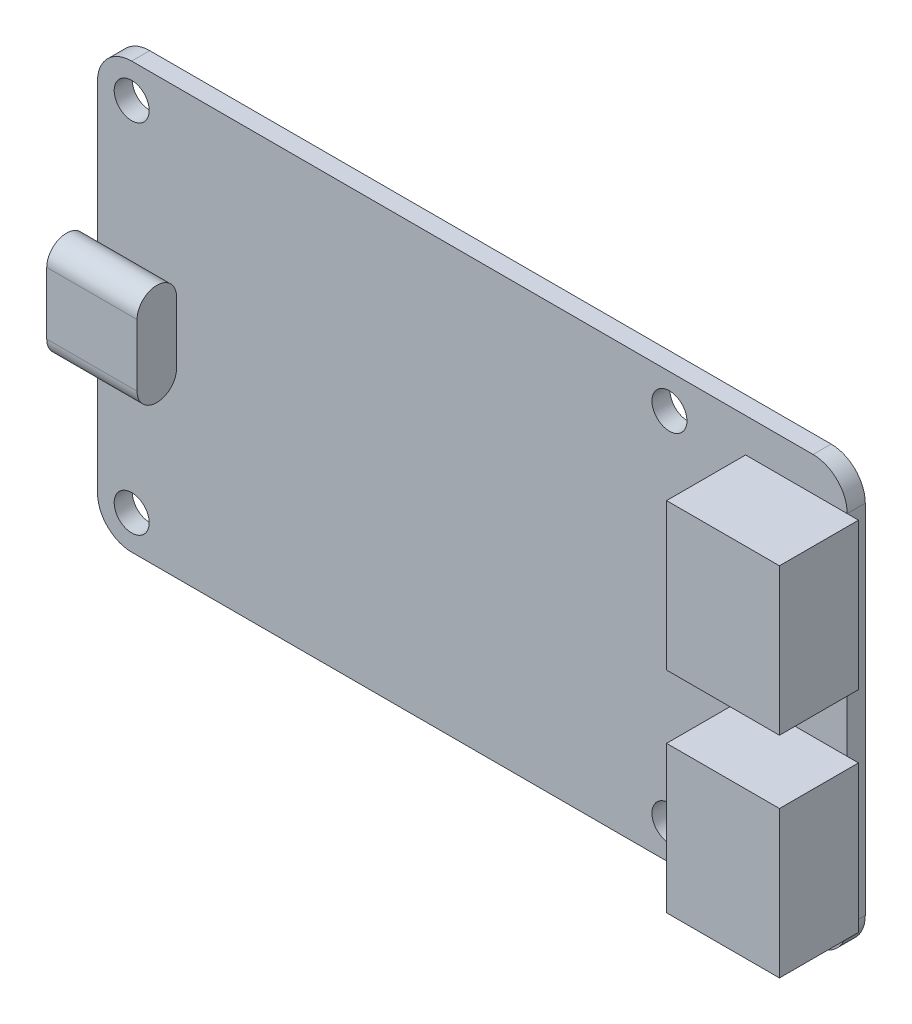
ISO-10303-21;
HEADER;
FILE_DESCRIPTION(('STEP AP214'),'2;1');
FILE_NAME('part.step','',(''),(''),'','','');
FILE_SCHEMA(('AUTOMOTIVE_DESIGN { 1 0 10303 214 1 1 1 1 }'));
ENDSEC;
DATA;
#1=APPLICATION_CONTEXT('core data for automotive mechanical design processes');
#2=APPLICATION_PROTOCOL_DEFINITION('international standard','automotive_design',2000,#1);
#3=PRODUCT_CONTEXT('',#1,'mechanical');
#4=PRODUCT('Part','Part','',(#3));
#5=PRODUCT_RELATED_PRODUCT_CATEGORY('part','',(#4));
#6=PRODUCT_DEFINITION_FORMATION('','',#4);
#7=PRODUCT_DEFINITION_CONTEXT('part definition',#1,'design');
#8=PRODUCT_DEFINITION('design','',#6,#7);
#9=PRODUCT_DEFINITION_SHAPE('','',#8);
#10=(LENGTH_UNIT() NAMED_UNIT(*) SI_UNIT(.MILLI.,.METRE.));
#11=(NAMED_UNIT(*) PLANE_ANGLE_UNIT() SI_UNIT($,.RADIAN.));
#12=(NAMED_UNIT(*) SI_UNIT($,.STERADIAN.) SOLID_ANGLE_UNIT());
#13=UNCERTAINTY_MEASURE_WITH_UNIT(LENGTH_MEASURE(1.E-05),#10,'distance_accuracy_value','');
#14=(GEOMETRIC_REPRESENTATION_CONTEXT(3) GLOBAL_UNCERTAINTY_ASSIGNED_CONTEXT((#13)) GLOBAL_UNIT_ASSIGNED_CONTEXT((#10,
#11,#12)) REPRESENTATION_CONTEXT('',''));
#15=CARTESIAN_POINT('',(0.,0.,0.));
#16=DIRECTION('',(0.,0.,1.));
#17=DIRECTION('',(1.,0.,0.));
#18=AXIS2_PLACEMENT_3D('',#15,#16,#17);
#19=CARTESIAN_POINT('',(-30.175,-15.81,1.6));
#20=DIRECTION('',(0.,0.,1.));
#21=DIRECTION('',(1.,0.,0.));
#22=AXIS2_PLACEMENT_3D('',#19,#20,#21);
#23=PLANE('',#22);
#24=DIRECTION('',(-1.,0.,0.));
#25=VECTOR('',#24,1.);
#26=CARTESIAN_POINT('',(-26.2,2.74999999999999,1.6));
#27=LINE('',#26,#25);
#28=CARTESIAN_POINT('',(-26.2,2.74999999999999,1.6));
#29=VERTEX_POINT('',#28);
#30=CARTESIAN_POINT('',(-33.2,2.74999999999999,1.6));
#31=VERTEX_POINT('',#30);
#32=EDGE_CURVE('E54',#29,#31,#27,.T.);
#33=ORIENTED_EDGE('',*,*,#32,.F.);
#34=DIRECTION('',(0.,-1.,0.));
#35=VECTOR('',#34,1.);
#36=CARTESIAN_POINT('',(-26.2,2.74999999999999,1.6));
#37=LINE('',#36,#35);
#38=CARTESIAN_POINT('',(-26.2,-2.75000000000001,1.6));
#39=VERTEX_POINT('',#38);
#40=EDGE_CURVE('E49',#29,#39,#37,.T.);
#41=ORIENTED_EDGE('',*,*,#40,.T.);
#42=DIRECTION('',(-1.,0.,0.));
#43=VECTOR('',#42,1.);
#44=CARTESIAN_POINT('',(-26.2,-2.75,1.6));
#45=LINE('',#44,#43);
#46=CARTESIAN_POINT('',(-33.2,-2.75000000000001,1.6));
#47=VERTEX_POINT('',#46);
#48=EDGE_CURVE('E224',#39,#47,#45,.T.);
#49=ORIENTED_EDGE('',*,*,#48,.T.);
#50=DIRECTION('',(0.,-1.,0.));
#51=VECTOR('',#50,1.);
#52=CARTESIAN_POINT('',(-33.2,15.81,1.6));
#53=LINE('',#52,#51);
#54=CARTESIAN_POINT('',(-33.2,-15.81,1.6));
#55=VERTEX_POINT('',#54);
#56=EDGE_CURVE('E335',#47,#55,#53,.T.);
#57=ORIENTED_EDGE('',*,*,#56,.T.);
#58=CARTESIAN_POINT('',(-30.175,-15.81,1.6));
#59=DIRECTION('',(0.,0.,1.));
#60=DIRECTION('',(1.,0.,0.));
#61=AXIS2_PLACEMENT_3D('',#58,#59,#60);
#62=CIRCLE('',#61,3.02499999999999);
#63=CARTESIAN_POINT('',(-30.175,-18.835,1.6));
#64=VERTEX_POINT('',#63);
#65=EDGE_CURVE('E316',#55,#64,#62,.T.);
#66=ORIENTED_EDGE('',*,*,#65,.T.);
#67=DIRECTION('',(1.,0.,0.));
#68=VECTOR('',#67,1.);
#69=CARTESIAN_POINT('',(-30.175,-18.835,1.6));
#70=LINE('',#69,#68);
#71=CARTESIAN_POINT('',(30.175,-18.835,1.6));
#72=VERTEX_POINT('',#71);
#73=EDGE_CURVE('E319',#64,#72,#70,.T.);
#74=ORIENTED_EDGE('',*,*,#73,.T.);
#75=CARTESIAN_POINT('',(30.175,-15.81,1.6));
#76=DIRECTION('',(0.,0.,1.));
#77=DIRECTION('',(1.,0.,0.));
#78=AXIS2_PLACEMENT_3D('',#75,#76,#77);
#79=CIRCLE('',#78,3.025);
#80=CARTESIAN_POINT('',(33.2,-15.81,1.6));
#81=VERTEX_POINT('',#80);
#82=EDGE_CURVE('E322',#72,#81,#79,.T.);
#83=ORIENTED_EDGE('',*,*,#82,.T.);
#84=DIRECTION('',(1.,0.,0.));
#85=VECTOR('',#84,1.);
#86=CARTESIAN_POINT('',(24.2,-15.81,1.6));
#87=LINE('',#86,#85);
#88=CARTESIAN_POINT('',(24.2,-15.81,1.6));
#89=VERTEX_POINT('',#88);
#90=EDGE_CURVE('E240',#89,#81,#87,.T.);
#91=ORIENTED_EDGE('',*,*,#90,.F.);
#92=DIRECTION('',(0.,-1.,0.));
#93=VECTOR('',#92,1.);
#94=CARTESIAN_POINT('',(24.2,-15.81,1.6));
#95=LINE('',#94,#93);
#96=CARTESIAN_POINT('',(24.2,-2.81,1.6));
#97=VERTEX_POINT('',#96);
#98=EDGE_CURVE('E221',#97,#89,#95,.T.);
#99=ORIENTED_EDGE('',*,*,#98,.F.);
#100=DIRECTION('',(-1.,0.,0.));
#101=VECTOR('',#100,1.);
#102=CARTESIAN_POINT('',(24.2,-2.81,1.6));
#103=LINE('',#102,#101);
#104=CARTESIAN_POINT('',(33.2,-2.81,1.6));
#105=VERTEX_POINT('',#104);
#106=EDGE_CURVE('E245',#105,#97,#103,.T.);
#107=ORIENTED_EDGE('',*,*,#106,.F.);
#108=DIRECTION('',(0.,1.,0.));
#109=VECTOR('',#108,1.);
#110=CARTESIAN_POINT('',(33.2,15.81,1.6));
#111=LINE('',#110,#109);
#112=CARTESIAN_POINT('',(33.2,2.81,1.6));
#113=VERTEX_POINT('',#112);
#114=EDGE_CURVE('E329',#105,#113,#111,.T.);
#115=ORIENTED_EDGE('',*,*,#114,.T.);
#116=DIRECTION('',(1.,0.,0.));
#117=VECTOR('',#116,1.);
#118=CARTESIAN_POINT('',(24.2,2.81,1.6));
#119=LINE('',#118,#117);
#120=CARTESIAN_POINT('',(24.2,2.81,1.6));
#121=VERTEX_POINT('',#120);
#122=EDGE_CURVE('E264',#121,#113,#119,.T.);
#123=ORIENTED_EDGE('',*,*,#122,.F.);
#124=DIRECTION('',(0.,-1.,0.));
#125=VECTOR('',#124,1.);
#126=CARTESIAN_POINT('',(24.2,15.81,1.6));
#127=LINE('',#126,#125);
#128=CARTESIAN_POINT('',(24.2,15.81,1.6));
#129=VERTEX_POINT('',#128);
#130=EDGE_CURVE('E274',#129,#121,#127,.T.);
#131=ORIENTED_EDGE('',*,*,#130,.F.);
#132=DIRECTION('',(-1.,0.,0.));
#133=VECTOR('',#132,1.);
#134=CARTESIAN_POINT('',(24.2,15.81,1.6));
#135=LINE('',#134,#133);
#136=CARTESIAN_POINT('',(33.2,15.81,1.6));
#137=VERTEX_POINT('',#136);
#138=EDGE_CURVE('E11',#137,#129,#135,.T.);
#139=ORIENTED_EDGE('',*,*,#138,.F.);
#140=CARTESIAN_POINT('',(30.175,15.81,1.6));
#141=DIRECTION('',(0.,0.,1.));
#142=DIRECTION('',(-1.,0.,0.));
#143=AXIS2_PLACEMENT_3D('',#140,#141,#142);
#144=CIRCLE('',#143,3.025);
#145=CARTESIAN_POINT('',(30.175,18.835,1.6));
#146=VERTEX_POINT('',#145);
#147=EDGE_CURVE('E328',#137,#146,#144,.T.);
#148=ORIENTED_EDGE('',*,*,#147,.T.);
#149=DIRECTION('',(-1.,0.,0.));
#150=VECTOR('',#149,1.);
#151=CARTESIAN_POINT('',(-30.175,18.835,1.6));
#152=LINE('',#151,#150);
#153=CARTESIAN_POINT('',(-30.175,18.835,1.6));
#154=VERTEX_POINT('',#153);
#155=EDGE_CURVE('E331',#146,#154,#152,.T.);
#156=ORIENTED_EDGE('',*,*,#155,.T.);
#157=CARTESIAN_POINT('',(-30.175,15.81,1.6));
#158=DIRECTION('',(0.,0.,1.));
#159=DIRECTION('',(1.,0.,0.));
#160=AXIS2_PLACEMENT_3D('',#157,#158,#159);
#161=CIRCLE('',#160,3.02499999999999);
#162=CARTESIAN_POINT('',(-33.2,15.81,1.6));
#163=VERTEX_POINT('',#162);
#164=EDGE_CURVE('E333',#154,#163,#161,.T.);
#165=ORIENTED_EDGE('',*,*,#164,.T.);
#166=EDGE_CURVE('E336',#163,#31,#53,.T.);
#167=ORIENTED_EDGE('',*,*,#166,.T.);
#168=EDGE_LOOP('',(#33,#41,#49,#57,#66,#74,#83,#91,#99,#107,#115,#123,#131,#139,#148,#156,#165,#167));
#169=FACE_BOUND('',#168,.T.);
#170=CARTESIAN_POINT('',(17.455,15.81,1.6));
#171=DIRECTION('',(0.,0.,1.));
#172=DIRECTION('',(1.,0.,0.));
#173=AXIS2_PLACEMENT_3D('',#170,#171,#172);
#174=CIRCLE('',#173,1.55);
#175=CARTESIAN_POINT('',(19.005,15.81,1.6));
#176=VERTEX_POINT('',#175);
#177=EDGE_CURVE('E298',#176,#176,#174,.T.);
#178=ORIENTED_EDGE('',*,*,#177,.F.);
#179=EDGE_LOOP('',(#178));
#180=FACE_BOUND('',#179,.T.);
#181=CARTESIAN_POINT('',(-30.175,15.81,1.6));
#182=DIRECTION('',(0.,0.,1.));
#183=DIRECTION('',(1.,0.,0.));
#184=AXIS2_PLACEMENT_3D('',#181,#182,#183);
#185=CIRCLE('',#184,1.55);
#186=CARTESIAN_POINT('',(-28.625,15.81,1.6));
#187=VERTEX_POINT('',#186);
#188=EDGE_CURVE('E310',#187,#187,#185,.T.);
#189=ORIENTED_EDGE('',*,*,#188,.F.);
#190=EDGE_LOOP('',(#189));
#191=FACE_BOUND('',#190,.T.);
#192=CARTESIAN_POINT('',(-30.175,-15.81,1.6));
#193=DIRECTION('',(0.,0.,1.));
#194=DIRECTION('',(1.,0.,0.));
#195=AXIS2_PLACEMENT_3D('',#192,#193,#194);
#196=CIRCLE('',#195,1.55);
#197=CARTESIAN_POINT('',(-28.625,-15.81,1.6));
#198=VERTEX_POINT('',#197);
#199=EDGE_CURVE('E304',#198,#198,#196,.T.);
#200=ORIENTED_EDGE('',*,*,#199,.F.);
#201=EDGE_LOOP('',(#200));
#202=FACE_BOUND('',#201,.T.);
#203=CARTESIAN_POINT('',(17.455,-15.81,1.6));
#204=DIRECTION('',(0.,0.,1.));
#205=DIRECTION('',(1.,0.,0.));
#206=AXIS2_PLACEMENT_3D('',#203,#204,#205);
#207=CIRCLE('',#206,1.55);
#208=CARTESIAN_POINT('',(19.005,-15.81,1.6));
#209=VERTEX_POINT('',#208);
#210=EDGE_CURVE('E292',#209,#209,#207,.T.);
#211=ORIENTED_EDGE('',*,*,#210,.F.);
#212=EDGE_LOOP('',(#211));
#213=FACE_BOUND('',#212,.T.);
#214=ADVANCED_FACE('F32',(#169,#180,#191,#202,#213),#23,.T.);
#215=CARTESIAN_POINT('',(-30.175,-15.81,0.));
#216=DIRECTION('',(0.,0.,1.));
#217=DIRECTION('',(1.,0.,0.));
#218=AXIS2_PLACEMENT_3D('',#215,#216,#217);
#219=PLANE('',#218);
#220=CARTESIAN_POINT('',(-30.175,-15.81,0.));
#221=DIRECTION('',(0.,0.,1.));
#222=DIRECTION('',(1.,0.,0.));
#223=AXIS2_PLACEMENT_3D('',#220,#221,#222);
#224=CIRCLE('',#223,3.02499999999999);
#225=CARTESIAN_POINT('',(-33.2,-15.81,0.));
#226=VERTEX_POINT('',#225);
#227=CARTESIAN_POINT('',(-30.175,-18.835,0.));
#228=VERTEX_POINT('',#227);
#229=EDGE_CURVE('E313',#226,#228,#224,.T.);
#230=ORIENTED_EDGE('',*,*,#229,.F.);
#231=DIRECTION('',(0.,-1.,0.));
#232=VECTOR('',#231,1.);
#233=CARTESIAN_POINT('',(-33.2,15.81,0.));
#234=LINE('',#233,#232);
#235=CARTESIAN_POINT('',(-33.2,15.81,0.));
#236=VERTEX_POINT('',#235);
#237=EDGE_CURVE('E320',#236,#226,#234,.T.);
#238=ORIENTED_EDGE('',*,*,#237,.F.);
#239=CARTESIAN_POINT('',(-30.175,15.81,0.));
#240=DIRECTION('',(0.,0.,1.));
#241=DIRECTION('',(1.,0.,0.));
#242=AXIS2_PLACEMENT_3D('',#239,#240,#241);
#243=CIRCLE('',#242,3.02499999999999);
#244=CARTESIAN_POINT('',(-30.175,18.835,0.));
#245=VERTEX_POINT('',#244);
#246=EDGE_CURVE('E352',#245,#236,#243,.T.);
#247=ORIENTED_EDGE('',*,*,#246,.F.);
#248=DIRECTION('',(-1.,0.,0.));
#249=VECTOR('',#248,1.);
#250=CARTESIAN_POINT('',(-30.175,18.835,0.));
#251=LINE('',#250,#249);
#252=CARTESIAN_POINT('',(30.175,18.835,0.));
#253=VERTEX_POINT('',#252);
#254=EDGE_CURVE('E350',#253,#245,#251,.T.);
#255=ORIENTED_EDGE('',*,*,#254,.F.);
#256=CARTESIAN_POINT('',(30.175,15.81,0.));
#257=DIRECTION('',(0.,0.,1.));
#258=DIRECTION('',(-1.,0.,0.));
#259=AXIS2_PLACEMENT_3D('',#256,#257,#258);
#260=CIRCLE('',#259,3.025);
#261=CARTESIAN_POINT('',(33.2,15.81,0.));
#262=VERTEX_POINT('',#261);
#263=EDGE_CURVE('E348',#262,#253,#260,.T.);
#264=ORIENTED_EDGE('',*,*,#263,.F.);
#265=DIRECTION('',(0.,1.,0.));
#266=VECTOR('',#265,1.);
#267=CARTESIAN_POINT('',(33.2,15.81,0.));
#268=LINE('',#267,#266);
#269=CARTESIAN_POINT('',(33.2,-15.81,0.));
#270=VERTEX_POINT('',#269);
#271=EDGE_CURVE('E346',#270,#262,#268,.T.);
#272=ORIENTED_EDGE('',*,*,#271,.F.);
#273=CARTESIAN_POINT('',(30.175,-15.81,0.));
#274=DIRECTION('',(0.,0.,1.));
#275=DIRECTION('',(1.,0.,0.));
#276=AXIS2_PLACEMENT_3D('',#273,#274,#275);
#277=CIRCLE('',#276,3.025);
#278=CARTESIAN_POINT('',(30.175,-18.835,0.));
#279=VERTEX_POINT('',#278);
#280=EDGE_CURVE('E344',#279,#270,#277,.T.);
#281=ORIENTED_EDGE('',*,*,#280,.F.);
#282=DIRECTION('',(1.,0.,0.));
#283=VECTOR('',#282,1.);
#284=CARTESIAN_POINT('',(-30.175,-18.835,0.));
#285=LINE('',#284,#283);
#286=EDGE_CURVE('E342',#228,#279,#285,.T.);
#287=ORIENTED_EDGE('',*,*,#286,.F.);
#288=EDGE_LOOP('',(#230,#238,#247,#255,#264,#272,#281,#287));
#289=FACE_BOUND('',#288,.T.);
#290=CARTESIAN_POINT('',(-30.175,15.81,0.));
#291=DIRECTION('',(0.,0.,1.));
#292=DIRECTION('',(1.,0.,0.));
#293=AXIS2_PLACEMENT_3D('',#290,#291,#292);
#294=CIRCLE('',#293,1.55);
#295=CARTESIAN_POINT('',(-28.625,15.81,0.));
#296=VERTEX_POINT('',#295);
#297=EDGE_CURVE('E307',#296,#296,#294,.T.);
#298=ORIENTED_EDGE('',*,*,#297,.T.);
#299=EDGE_LOOP('',(#298));
#300=FACE_BOUND('',#299,.T.);
#301=CARTESIAN_POINT('',(-30.175,-15.81,0.));
#302=DIRECTION('',(0.,0.,1.));
#303=DIRECTION('',(1.,0.,0.));
#304=AXIS2_PLACEMENT_3D('',#301,#302,#303);
#305=CIRCLE('',#304,1.55);
#306=CARTESIAN_POINT('',(-28.625,-15.81,0.));
#307=VERTEX_POINT('',#306);
#308=EDGE_CURVE('E301',#307,#307,#305,.T.);
#309=ORIENTED_EDGE('',*,*,#308,.T.);
#310=EDGE_LOOP('',(#309));
#311=FACE_BOUND('',#310,.T.);
#312=CARTESIAN_POINT('',(17.455,15.81,0.));
#313=DIRECTION('',(0.,0.,1.));
#314=DIRECTION('',(1.,0.,0.));
#315=AXIS2_PLACEMENT_3D('',#312,#313,#314);
#316=CIRCLE('',#315,1.55);
#317=CARTESIAN_POINT('',(19.005,15.81,0.));
#318=VERTEX_POINT('',#317);
#319=EDGE_CURVE('E295',#318,#318,#316,.T.);
#320=ORIENTED_EDGE('',*,*,#319,.T.);
#321=EDGE_LOOP('',(#320));
#322=FACE_BOUND('',#321,.T.);
#323=CARTESIAN_POINT('',(17.455,-15.81,0.));
#324=DIRECTION('',(0.,0.,1.));
#325=DIRECTION('',(1.,0.,0.));
#326=AXIS2_PLACEMENT_3D('',#323,#324,#325);
#327=CIRCLE('',#326,1.55);
#328=CARTESIAN_POINT('',(19.005,-15.81,0.));
#329=VERTEX_POINT('',#328);
#330=EDGE_CURVE('E291',#329,#329,#327,.T.);
#331=ORIENTED_EDGE('',*,*,#330,.T.);
#332=EDGE_LOOP('',(#331));
#333=FACE_BOUND('',#332,.T.);
#334=ADVANCED_FACE('F387',(#289,#300,#311,#322,#333),#219,.F.);
#335=CARTESIAN_POINT('',(-30.175,-15.81,1.6));
#336=DIRECTION('',(0.,0.,-1.));
#337=DIRECTION('',(-1.,0.,0.));
#338=AXIS2_PLACEMENT_3D('',#335,#336,#337);
#339=CYLINDRICAL_SURFACE('',#338,3.02499999999999);
#340=ORIENTED_EDGE('',*,*,#229,.T.);
#341=DIRECTION('',(0.,0.,-1.));
#342=VECTOR('',#341,1.);
#343=CARTESIAN_POINT('',(-30.175,-18.835,1.6));
#344=LINE('',#343,#342);
#345=EDGE_CURVE('E36',#64,#228,#344,.T.);
#346=ORIENTED_EDGE('',*,*,#345,.F.);
#347=ORIENTED_EDGE('',*,*,#65,.F.);
#348=DIRECTION('',(0.,0.,-1.));
#349=VECTOR('',#348,1.);
#350=CARTESIAN_POINT('',(-33.2,-15.81,1.6));
#351=LINE('',#350,#349);
#352=EDGE_CURVE('E338',#55,#226,#351,.T.);
#353=ORIENTED_EDGE('',*,*,#352,.T.);
#354=EDGE_LOOP('',(#340,#346,#347,#353));
#355=FACE_BOUND('',#354,.T.);
#356=ADVANCED_FACE('F34',(#355),#339,.T.);
#357=CARTESIAN_POINT('',(-30.175,-18.835,1.6));
#358=DIRECTION('',(0.,1.,0.));
#359=DIRECTION('',(-1.,0.,0.));
#360=AXIS2_PLACEMENT_3D('',#357,#358,#359);
#361=PLANE('',#360);
#362=ORIENTED_EDGE('',*,*,#286,.T.);
#363=DIRECTION('',(0.,0.,-1.));
#364=VECTOR('',#363,1.);
#365=CARTESIAN_POINT('',(30.175,-18.835,1.6));
#366=LINE('',#365,#364);
#367=EDGE_CURVE('E371',#72,#279,#366,.T.);
#368=ORIENTED_EDGE('',*,*,#367,.F.);
#369=ORIENTED_EDGE('',*,*,#73,.F.);
#370=ORIENTED_EDGE('',*,*,#345,.T.);
#371=EDGE_LOOP('',(#362,#368,#369,#370));
#372=FACE_BOUND('',#371,.T.);
#373=ADVANCED_FACE('F380',(#372),#361,.F.);
#374=CARTESIAN_POINT('',(30.175,-15.81,1.6));
#375=DIRECTION('',(0.,0.,-1.));
#376=DIRECTION('',(-1.,0.,0.));
#377=AXIS2_PLACEMENT_3D('',#374,#375,#376);
#378=CYLINDRICAL_SURFACE('',#377,3.025);
#379=ORIENTED_EDGE('',*,*,#280,.T.);
#380=DIRECTION('',(0.,0.,-1.));
#381=VECTOR('',#380,1.);
#382=CARTESIAN_POINT('',(33.2,-15.81,1.6));
#383=LINE('',#382,#381);
#384=EDGE_CURVE('E369',#81,#270,#383,.T.);
#385=ORIENTED_EDGE('',*,*,#384,.F.);
#386=ORIENTED_EDGE('',*,*,#82,.F.);
#387=ORIENTED_EDGE('',*,*,#367,.T.);
#388=EDGE_LOOP('',(#379,#385,#386,#387));
#389=FACE_BOUND('',#388,.T.);
#390=ADVANCED_FACE('F393',(#389),#378,.T.);
#391=CARTESIAN_POINT('',(33.2,15.81,1.6));
#392=DIRECTION('',(-1.,0.,0.));
#393=DIRECTION('',(0.,0.,1.));
#394=AXIS2_PLACEMENT_3D('',#391,#392,#393);
#395=PLANE('',#394);
#396=ORIENTED_EDGE('',*,*,#271,.T.);
#397=DIRECTION('',(0.,0.,-1.));
#398=VECTOR('',#397,1.);
#399=CARTESIAN_POINT('',(33.2,15.81,1.6));
#400=LINE('',#399,#398);
#401=EDGE_CURVE('E366',#137,#262,#400,.T.);
#402=ORIENTED_EDGE('',*,*,#401,.F.);
#403=EDGE_CURVE('E324',#113,#137,#111,.T.);
#404=ORIENTED_EDGE('',*,*,#403,.F.);
#405=ORIENTED_EDGE('',*,*,#114,.F.);
#406=EDGE_CURVE('E325',#81,#105,#111,.T.);
#407=ORIENTED_EDGE('',*,*,#406,.F.);
#408=ORIENTED_EDGE('',*,*,#384,.T.);
#409=EDGE_LOOP('',(#396,#402,#404,#405,#407,#408));
#410=FACE_BOUND('',#409,.T.);
#411=ADVANCED_FACE('F396',(#410),#395,.F.);
#412=CARTESIAN_POINT('',(30.175,15.81,1.6));
#413=DIRECTION('',(0.,0.,-1.));
#414=DIRECTION('',(-1.,0.,0.));
#415=AXIS2_PLACEMENT_3D('',#412,#413,#414);
#416=CYLINDRICAL_SURFACE('',#415,3.025);
#417=ORIENTED_EDGE('',*,*,#263,.T.);
#418=DIRECTION('',(0.,0.,-1.));
#419=VECTOR('',#418,1.);
#420=CARTESIAN_POINT('',(30.175,18.835,1.6));
#421=LINE('',#420,#419);
#422=EDGE_CURVE('E363',#146,#253,#421,.T.);
#423=ORIENTED_EDGE('',*,*,#422,.F.);
#424=ORIENTED_EDGE('',*,*,#147,.F.);
#425=ORIENTED_EDGE('',*,*,#401,.T.);
#426=EDGE_LOOP('',(#417,#423,#424,#425));
#427=FACE_BOUND('',#426,.T.);
#428=ADVANCED_FACE('F426',(#427),#416,.T.);
#429=CARTESIAN_POINT('',(-30.175,18.835,1.6));
#430=DIRECTION('',(0.,-1.,0.));
#431=DIRECTION('',(1.,0.,0.));
#432=AXIS2_PLACEMENT_3D('',#429,#430,#431);
#433=PLANE('',#432);
#434=ORIENTED_EDGE('',*,*,#254,.T.);
#435=DIRECTION('',(0.,0.,-1.));
#436=VECTOR('',#435,1.);
#437=CARTESIAN_POINT('',(-30.175,18.835,1.6));
#438=LINE('',#437,#436);
#439=EDGE_CURVE('E360',#154,#245,#438,.T.);
#440=ORIENTED_EDGE('',*,*,#439,.F.);
#441=ORIENTED_EDGE('',*,*,#155,.F.);
#442=ORIENTED_EDGE('',*,*,#422,.T.);
#443=EDGE_LOOP('',(#434,#440,#441,#442));
#444=FACE_BOUND('',#443,.T.);
#445=ADVANCED_FACE('F421',(#444),#433,.F.);
#446=CARTESIAN_POINT('',(-30.175,15.81,1.6));
#447=DIRECTION('',(0.,0.,-1.));
#448=DIRECTION('',(-1.,0.,0.));
#449=AXIS2_PLACEMENT_3D('',#446,#447,#448);
#450=CYLINDRICAL_SURFACE('',#449,3.02499999999999);
#451=ORIENTED_EDGE('',*,*,#246,.T.);
#452=DIRECTION('',(0.,0.,-1.));
#453=VECTOR('',#452,1.);
#454=CARTESIAN_POINT('',(-33.2,15.81,1.6));
#455=LINE('',#454,#453);
#456=EDGE_CURVE('E357',#163,#236,#455,.T.);
#457=ORIENTED_EDGE('',*,*,#456,.F.);
#458=ORIENTED_EDGE('',*,*,#164,.F.);
#459=ORIENTED_EDGE('',*,*,#439,.T.);
#460=EDGE_LOOP('',(#451,#457,#458,#459));
#461=FACE_BOUND('',#460,.T.);
#462=ADVANCED_FACE('F417',(#461),#450,.T.);
#463=CARTESIAN_POINT('',(-33.2,15.81,1.6));
#464=DIRECTION('',(1.,0.,0.));
#465=DIRECTION('',(0.,1.,0.));
#466=AXIS2_PLACEMENT_3D('',#463,#464,#465);
#467=PLANE('',#466);
#468=ORIENTED_EDGE('',*,*,#237,.T.);
#469=ORIENTED_EDGE('',*,*,#352,.F.);
#470=ORIENTED_EDGE('',*,*,#56,.F.);
#471=EDGE_CURVE('E339',#31,#47,#53,.T.);
#472=ORIENTED_EDGE('',*,*,#471,.F.);
#473=ORIENTED_EDGE('',*,*,#166,.F.);
#474=ORIENTED_EDGE('',*,*,#456,.T.);
#475=EDGE_LOOP('',(#468,#469,#470,#472,#473,#474));
#476=FACE_BOUND('',#475,.T.);
#477=ADVANCED_FACE('F412',(#476),#467,.F.);
#478=CARTESIAN_POINT('',(-30.175,15.81,1.6));
#479=DIRECTION('',(0.,0.,-1.));
#480=DIRECTION('',(-1.,0.,0.));
#481=AXIS2_PLACEMENT_3D('',#478,#479,#480);
#482=CYLINDRICAL_SURFACE('',#481,1.55);
#483=ORIENTED_EDGE('',*,*,#188,.T.);
#484=EDGE_LOOP('',(#483));
#485=FACE_BOUND('',#484,.T.);
#486=ORIENTED_EDGE('',*,*,#297,.F.);
#487=EDGE_LOOP('',(#486));
#488=FACE_BOUND('',#487,.T.);
#489=ADVANCED_FACE('F467',(#485,#488),#482,.F.);
#490=CARTESIAN_POINT('',(-30.175,-15.81,1.6));
#491=DIRECTION('',(0.,0.,-1.));
#492=DIRECTION('',(-1.,0.,0.));
#493=AXIS2_PLACEMENT_3D('',#490,#491,#492);
#494=CYLINDRICAL_SURFACE('',#493,1.55);
#495=ORIENTED_EDGE('',*,*,#199,.T.);
#496=EDGE_LOOP('',(#495));
#497=FACE_BOUND('',#496,.T.);
#498=ORIENTED_EDGE('',*,*,#308,.F.);
#499=EDGE_LOOP('',(#498));
#500=FACE_BOUND('',#499,.T.);
#501=ADVANCED_FACE('F540',(#497,#500),#494,.F.);
#502=CARTESIAN_POINT('',(17.455,15.81,1.6));
#503=DIRECTION('',(0.,0.,-1.));
#504=DIRECTION('',(-1.,0.,0.));
#505=AXIS2_PLACEMENT_3D('',#502,#503,#504);
#506=CYLINDRICAL_SURFACE('',#505,1.55);
#507=ORIENTED_EDGE('',*,*,#177,.T.);
#508=EDGE_LOOP('',(#507));
#509=FACE_BOUND('',#508,.T.);
#510=ORIENTED_EDGE('',*,*,#319,.F.);
#511=EDGE_LOOP('',(#510));
#512=FACE_BOUND('',#511,.T.);
#513=ADVANCED_FACE('F548',(#509,#512),#506,.F.);
#514=CARTESIAN_POINT('',(17.455,-15.81,1.6));
#515=DIRECTION('',(0.,0.,-1.));
#516=DIRECTION('',(-1.,0.,0.));
#517=AXIS2_PLACEMENT_3D('',#514,#515,#516);
#518=CYLINDRICAL_SURFACE('',#517,1.55);
#519=ORIENTED_EDGE('',*,*,#210,.T.);
#520=EDGE_LOOP('',(#519));
#521=FACE_BOUND('',#520,.T.);
#522=ORIENTED_EDGE('',*,*,#330,.F.);
#523=EDGE_LOOP('',(#522));
#524=FACE_BOUND('',#523,.T.);
#525=ADVANCED_FACE('F556',(#521,#524),#518,.F.);
#526=CARTESIAN_POINT('',(0.,0.,1.6));
#527=DIRECTION('',(0.,0.,1.));
#528=DIRECTION('',(1.,0.,0.));
#529=AXIS2_PLACEMENT_3D('',#526,#527,#528);
#530=PLANE('',#529);
#531=CARTESIAN_POINT('',(34.2,2.81,1.6));
#532=VERTEX_POINT('',#531);
#533=EDGE_CURVE('E277',#113,#532,#119,.T.);
#534=ORIENTED_EDGE('',*,*,#533,.F.);
#535=ORIENTED_EDGE('',*,*,#403,.T.);
#536=CARTESIAN_POINT('',(34.2,15.81,1.6));
#537=VERTEX_POINT('',#536);
#538=EDGE_CURVE('E42',#537,#137,#135,.T.);
#539=ORIENTED_EDGE('',*,*,#538,.F.);
#540=DIRECTION('',(0.,1.,0.));
#541=VECTOR('',#540,1.);
#542=CARTESIAN_POINT('',(34.2,15.81,1.6));
#543=LINE('',#542,#541);
#544=EDGE_CURVE('E259',#532,#537,#543,.T.);
#545=ORIENTED_EDGE('',*,*,#544,.F.);
#546=EDGE_LOOP('',(#534,#535,#539,#545));
#547=FACE_BOUND('',#546,.T.);
#548=ADVANCED_FACE('F431',(#547),#530,.F.);
#549=CARTESIAN_POINT('',(34.2,15.81,8.6));
#550=DIRECTION('',(-1.,0.,0.));
#551=DIRECTION('',(0.,-1.,0.));
#552=AXIS2_PLACEMENT_3D('',#549,#550,#551);
#553=PLANE('',#552);
#554=ORIENTED_EDGE('',*,*,#544,.T.);
#555=DIRECTION('',(0.,0.,-1.));
#556=VECTOR('',#555,1.);
#557=CARTESIAN_POINT('',(34.2,15.81,8.6));
#558=LINE('',#557,#556);
#559=CARTESIAN_POINT('',(34.2,15.81,8.6));
#560=VERTEX_POINT('',#559);
#561=EDGE_CURVE('E288',#560,#537,#558,.T.);
#562=ORIENTED_EDGE('',*,*,#561,.F.);
#563=DIRECTION('',(0.,1.,0.));
#564=VECTOR('',#563,1.);
#565=CARTESIAN_POINT('',(34.2,15.81,8.6));
#566=LINE('',#565,#564);
#567=CARTESIAN_POINT('',(34.2,2.81,8.6));
#568=VERTEX_POINT('',#567);
#569=EDGE_CURVE('E260',#568,#560,#566,.T.);
#570=ORIENTED_EDGE('',*,*,#569,.F.);
#571=DIRECTION('',(0.,0.,-1.));
#572=VECTOR('',#571,1.);
#573=CARTESIAN_POINT('',(34.2,2.81,8.6));
#574=LINE('',#573,#572);
#575=EDGE_CURVE('E270',#568,#532,#574,.T.);
#576=ORIENTED_EDGE('',*,*,#575,.T.);
#577=EDGE_LOOP('',(#554,#562,#570,#576));
#578=FACE_BOUND('',#577,.T.);
#579=ADVANCED_FACE('F446',(#578),#553,.F.);
#580=CARTESIAN_POINT('',(24.2,15.81,8.6));
#581=DIRECTION('',(0.,-1.,0.));
#582=DIRECTION('',(0.,0.,-1.));
#583=AXIS2_PLACEMENT_3D('',#580,#581,#582);
#584=PLANE('',#583);
#585=ORIENTED_EDGE('',*,*,#538,.T.);
#586=ORIENTED_EDGE('',*,*,#138,.T.);
#587=DIRECTION('',(0.,0.,-1.));
#588=VECTOR('',#587,1.);
#589=CARTESIAN_POINT('',(24.2,15.81,8.6));
#590=LINE('',#589,#588);
#591=CARTESIAN_POINT('',(24.2,15.81,8.6));
#592=VERTEX_POINT('',#591);
#593=EDGE_CURVE('E285',#592,#129,#590,.T.);
#594=ORIENTED_EDGE('',*,*,#593,.F.);
#595=DIRECTION('',(-1.,0.,0.));
#596=VECTOR('',#595,1.);
#597=CARTESIAN_POINT('',(24.2,15.81,8.6));
#598=LINE('',#597,#596);
#599=EDGE_CURVE('E263',#560,#592,#598,.T.);
#600=ORIENTED_EDGE('',*,*,#599,.F.);
#601=ORIENTED_EDGE('',*,*,#561,.T.);
#602=EDGE_LOOP('',(#585,#586,#594,#600,#601));
#603=FACE_BOUND('',#602,.T.);
#604=ADVANCED_FACE('F442',(#603),#584,.F.);
#605=CARTESIAN_POINT('',(24.2,15.81,8.6));
#606=DIRECTION('',(1.,0.,0.));
#607=DIRECTION('',(0.,1.,0.));
#608=AXIS2_PLACEMENT_3D('',#605,#606,#607);
#609=PLANE('',#608);
#610=ORIENTED_EDGE('',*,*,#130,.T.);
#611=DIRECTION('',(0.,0.,-1.));
#612=VECTOR('',#611,1.);
#613=CARTESIAN_POINT('',(24.2,2.81,8.6));
#614=LINE('',#613,#612);
#615=CARTESIAN_POINT('',(24.2,2.81,8.6));
#616=VERTEX_POINT('',#615);
#617=EDGE_CURVE('E282',#616,#121,#614,.T.);
#618=ORIENTED_EDGE('',*,*,#617,.F.);
#619=DIRECTION('',(0.,-1.,0.));
#620=VECTOR('',#619,1.);
#621=CARTESIAN_POINT('',(24.2,15.81,8.6));
#622=LINE('',#621,#620);
#623=EDGE_CURVE('E266',#592,#616,#622,.T.);
#624=ORIENTED_EDGE('',*,*,#623,.F.);
#625=ORIENTED_EDGE('',*,*,#593,.T.);
#626=EDGE_LOOP('',(#610,#618,#624,#625));
#627=FACE_BOUND('',#626,.T.);
#628=ADVANCED_FACE('F438',(#627),#609,.F.);
#629=CARTESIAN_POINT('',(24.2,2.81,8.6));
#630=DIRECTION('',(0.,1.,0.));
#631=DIRECTION('',(0.,0.,1.));
#632=AXIS2_PLACEMENT_3D('',#629,#630,#631);
#633=PLANE('',#632);
#634=ORIENTED_EDGE('',*,*,#122,.T.);
#635=ORIENTED_EDGE('',*,*,#533,.T.);
#636=ORIENTED_EDGE('',*,*,#575,.F.);
#637=DIRECTION('',(1.,0.,0.));
#638=VECTOR('',#637,1.);
#639=CARTESIAN_POINT('',(24.2,2.81,8.6));
#640=LINE('',#639,#638);
#641=EDGE_CURVE('E268',#616,#568,#640,.T.);
#642=ORIENTED_EDGE('',*,*,#641,.F.);
#643=ORIENTED_EDGE('',*,*,#617,.T.);
#644=EDGE_LOOP('',(#634,#635,#636,#642,#643));
#645=FACE_BOUND('',#644,.T.);
#646=ADVANCED_FACE('F434',(#645),#633,.F.);
#647=CARTESIAN_POINT('',(0.,0.,8.6));
#648=DIRECTION('',(0.,0.,1.));
#649=DIRECTION('',(1.,0.,0.));
#650=AXIS2_PLACEMENT_3D('',#647,#648,#649);
#651=PLANE('',#650);
#652=ORIENTED_EDGE('',*,*,#569,.T.);
#653=ORIENTED_EDGE('',*,*,#599,.T.);
#654=ORIENTED_EDGE('',*,*,#623,.T.);
#655=ORIENTED_EDGE('',*,*,#641,.T.);
#656=EDGE_LOOP('',(#652,#653,#654,#655));
#657=FACE_BOUND('',#656,.T.);
#658=ADVANCED_FACE('F448',(#657),#651,.T.);
#659=CARTESIAN_POINT('',(0.,0.,1.6));
#660=DIRECTION('',(0.,0.,-1.));
#661=DIRECTION('',(-1.,0.,0.));
#662=AXIS2_PLACEMENT_3D('',#659,#660,#661);
#663=PLANE('',#662);
#664=ORIENTED_EDGE('',*,*,#406,.T.);
#665=CARTESIAN_POINT('',(34.2,-2.81,1.6));
#666=VERTEX_POINT('',#665);
#667=EDGE_CURVE('E230',#666,#105,#103,.T.);
#668=ORIENTED_EDGE('',*,*,#667,.F.);
#669=DIRECTION('',(0.,1.,0.));
#670=VECTOR('',#669,1.);
#671=CARTESIAN_POINT('',(34.2,-15.81,1.6));
#672=LINE('',#671,#670);
#673=CARTESIAN_POINT('',(34.2,-15.81,1.6));
#674=VERTEX_POINT('',#673);
#675=EDGE_CURVE('E243',#674,#666,#672,.T.);
#676=ORIENTED_EDGE('',*,*,#675,.F.);
#677=EDGE_CURVE('E239',#81,#674,#87,.T.);
#678=ORIENTED_EDGE('',*,*,#677,.F.);
#679=EDGE_LOOP('',(#664,#668,#676,#678));
#680=FACE_BOUND('',#679,.T.);
#681=ADVANCED_FACE('F404',(#680),#663,.T.);
#682=CARTESIAN_POINT('',(24.2,-15.81,8.6));
#683=DIRECTION('',(1.,0.,0.));
#684=DIRECTION('',(0.,1.,0.));
#685=AXIS2_PLACEMENT_3D('',#682,#683,#684);
#686=PLANE('',#685);
#687=ORIENTED_EDGE('',*,*,#98,.T.);
#688=DIRECTION('',(0.,0.,-1.));
#689=VECTOR('',#688,1.);
#690=CARTESIAN_POINT('',(24.2,-15.81,8.6));
#691=LINE('',#690,#689);
#692=CARTESIAN_POINT('',(24.2,-15.81,8.6));
#693=VERTEX_POINT('',#692);
#694=EDGE_CURVE('E256',#693,#89,#691,.T.);
#695=ORIENTED_EDGE('',*,*,#694,.F.);
#696=DIRECTION('',(0.,-1.,0.));
#697=VECTOR('',#696,1.);
#698=CARTESIAN_POINT('',(24.2,-15.81,8.6));
#699=LINE('',#698,#697);
#700=CARTESIAN_POINT('',(24.2,-2.81,8.6));
#701=VERTEX_POINT('',#700);
#702=EDGE_CURVE('E226',#701,#693,#699,.T.);
#703=ORIENTED_EDGE('',*,*,#702,.F.);
#704=DIRECTION('',(0.,0.,-1.));
#705=VECTOR('',#704,1.);
#706=CARTESIAN_POINT('',(24.2,-2.81,8.6));
#707=LINE('',#706,#705);
#708=EDGE_CURVE('E236',#701,#97,#707,.T.);
#709=ORIENTED_EDGE('',*,*,#708,.T.);
#710=EDGE_LOOP('',(#687,#695,#703,#709));
#711=FACE_BOUND('',#710,.T.);
#712=ADVANCED_FACE('F455',(#711),#686,.F.);
#713=CARTESIAN_POINT('',(24.2,-15.81,8.6));
#714=DIRECTION('',(0.,1.,0.));
#715=DIRECTION('',(0.,0.,1.));
#716=AXIS2_PLACEMENT_3D('',#713,#714,#715);
#717=PLANE('',#716);
#718=ORIENTED_EDGE('',*,*,#90,.T.);
#719=ORIENTED_EDGE('',*,*,#677,.T.);
#720=DIRECTION('',(0.,0.,-1.));
#721=VECTOR('',#720,1.);
#722=CARTESIAN_POINT('',(34.2,-15.81,8.6));
#723=LINE('',#722,#721);
#724=CARTESIAN_POINT('',(34.2,-15.81,8.6));
#725=VERTEX_POINT('',#724);
#726=EDGE_CURVE('E253',#725,#674,#723,.T.);
#727=ORIENTED_EDGE('',*,*,#726,.F.);
#728=DIRECTION('',(1.,0.,0.));
#729=VECTOR('',#728,1.);
#730=CARTESIAN_POINT('',(24.2,-15.81,8.6));
#731=LINE('',#730,#729);
#732=EDGE_CURVE('E229',#693,#725,#731,.T.);
#733=ORIENTED_EDGE('',*,*,#732,.F.);
#734=ORIENTED_EDGE('',*,*,#694,.T.);
#735=EDGE_LOOP('',(#718,#719,#727,#733,#734));
#736=FACE_BOUND('',#735,.T.);
#737=ADVANCED_FACE('F407',(#736),#717,.F.);
#738=CARTESIAN_POINT('',(34.2,-15.81,8.6));
#739=DIRECTION('',(-1.,0.,0.));
#740=DIRECTION('',(0.,-1.,0.));
#741=AXIS2_PLACEMENT_3D('',#738,#739,#740);
#742=PLANE('',#741);
#743=ORIENTED_EDGE('',*,*,#675,.T.);
#744=DIRECTION('',(0.,0.,-1.));
#745=VECTOR('',#744,1.);
#746=CARTESIAN_POINT('',(34.2,-2.81,8.6));
#747=LINE('',#746,#745);
#748=CARTESIAN_POINT('',(34.2,-2.81,8.6));
#749=VERTEX_POINT('',#748);
#750=EDGE_CURVE('E250',#749,#666,#747,.T.);
#751=ORIENTED_EDGE('',*,*,#750,.F.);
#752=DIRECTION('',(0.,1.,0.));
#753=VECTOR('',#752,1.);
#754=CARTESIAN_POINT('',(34.2,-15.81,8.6));
#755=LINE('',#754,#753);
#756=EDGE_CURVE('E232',#725,#749,#755,.T.);
#757=ORIENTED_EDGE('',*,*,#756,.F.);
#758=ORIENTED_EDGE('',*,*,#726,.T.);
#759=EDGE_LOOP('',(#743,#751,#757,#758));
#760=FACE_BOUND('',#759,.T.);
#761=ADVANCED_FACE('F624',(#760),#742,.F.);
#762=CARTESIAN_POINT('',(24.2,-2.81,8.6));
#763=DIRECTION('',(0.,-1.,0.));
#764=DIRECTION('',(0.,0.,-1.));
#765=AXIS2_PLACEMENT_3D('',#762,#763,#764);
#766=PLANE('',#765);
#767=ORIENTED_EDGE('',*,*,#667,.T.);
#768=ORIENTED_EDGE('',*,*,#106,.T.);
#769=ORIENTED_EDGE('',*,*,#708,.F.);
#770=DIRECTION('',(-1.,0.,0.));
#771=VECTOR('',#770,1.);
#772=CARTESIAN_POINT('',(24.2,-2.81,8.6));
#773=LINE('',#772,#771);
#774=EDGE_CURVE('E234',#749,#701,#773,.T.);
#775=ORIENTED_EDGE('',*,*,#774,.F.);
#776=ORIENTED_EDGE('',*,*,#750,.T.);
#777=EDGE_LOOP('',(#767,#768,#769,#775,#776));
#778=FACE_BOUND('',#777,.T.);
#779=ADVANCED_FACE('F632',(#778),#766,.F.);
#780=CARTESIAN_POINT('',(0.,0.,8.6));
#781=DIRECTION('',(0.,0.,-1.));
#782=DIRECTION('',(-1.,0.,0.));
#783=AXIS2_PLACEMENT_3D('',#780,#781,#782);
#784=PLANE('',#783);
#785=ORIENTED_EDGE('',*,*,#702,.T.);
#786=ORIENTED_EDGE('',*,*,#732,.T.);
#787=ORIENTED_EDGE('',*,*,#756,.T.);
#788=ORIENTED_EDGE('',*,*,#774,.T.);
#789=EDGE_LOOP('',(#785,#786,#787,#788));
#790=FACE_BOUND('',#789,.T.);
#791=ADVANCED_FACE('F641',(#790),#784,.F.);
#792=CARTESIAN_POINT('',(-26.2,2.74999999999999,1.6));
#793=DIRECTION('',(0.,0.,-1.));
#794=DIRECTION('',(-1.,0.,0.));
#795=AXIS2_PLACEMENT_3D('',#792,#793,#794);
#796=PLANE('',#795);
#797=ORIENTED_EDGE('',*,*,#471,.T.);
#798=CARTESIAN_POINT('',(-34.2,-2.75000000000001,1.6));
#799=VERTEX_POINT('',#798);
#800=EDGE_CURVE('E197',#47,#799,#45,.T.);
#801=ORIENTED_EDGE('',*,*,#800,.T.);
#802=DIRECTION('',(0.,-1.,0.));
#803=VECTOR('',#802,1.);
#804=CARTESIAN_POINT('',(-34.2,2.74999999999999,1.6));
#805=LINE('',#804,#803);
#806=CARTESIAN_POINT('',(-34.2,2.74999999999999,1.6));
#807=VERTEX_POINT('',#806);
#808=EDGE_CURVE('E194',#807,#799,#805,.T.);
#809=ORIENTED_EDGE('',*,*,#808,.F.);
#810=EDGE_CURVE('E183',#31,#807,#27,.T.);
#811=ORIENTED_EDGE('',*,*,#810,.F.);
#812=EDGE_LOOP('',(#797,#801,#809,#811));
#813=FACE_BOUND('',#812,.T.);
#814=ADVANCED_FACE('F195',(#813),#796,.T.);
#815=CARTESIAN_POINT('',(-26.2,2.74999999999999,3.35));
#816=DIRECTION('',(-1.,0.,0.));
#817=DIRECTION('',(0.,-1.,0.));
#818=AXIS2_PLACEMENT_3D('',#815,#816,#817);
#819=CYLINDRICAL_SURFACE('',#818,1.75);
#820=ORIENTED_EDGE('',*,*,#32,.T.);
#821=ORIENTED_EDGE('',*,*,#810,.T.);
#822=CARTESIAN_POINT('',(-34.2,2.74999999999999,3.35));
#823=DIRECTION('',(-1.,0.,0.));
#824=DIRECTION('',(0.,-1.,0.));
#825=AXIS2_PLACEMENT_3D('',#822,#823,#824);
#826=CIRCLE('',#825,1.75);
#827=CARTESIAN_POINT('',(-34.2,2.74999999999999,5.1));
#828=VERTEX_POINT('',#827);
#829=EDGE_CURVE('E187',#828,#807,#826,.T.);
#830=ORIENTED_EDGE('',*,*,#829,.F.);
#831=DIRECTION('',(-1.,0.,0.));
#832=VECTOR('',#831,1.);
#833=CARTESIAN_POINT('',(-26.2,2.74999999999999,5.1));
#834=LINE('',#833,#832);
#835=CARTESIAN_POINT('',(-26.2,2.74999999999999,5.1));
#836=VERTEX_POINT('',#835);
#837=EDGE_CURVE('E219',#836,#828,#834,.T.);
#838=ORIENTED_EDGE('',*,*,#837,.F.);
#839=CARTESIAN_POINT('',(-26.2,2.74999999999999,3.35));
#840=DIRECTION('',(-1.,0.,0.));
#841=DIRECTION('',(0.,-1.,0.));
#842=AXIS2_PLACEMENT_3D('',#839,#840,#841);
#843=CIRCLE('',#842,1.75);
#844=EDGE_CURVE('E211',#836,#29,#843,.T.);
#845=ORIENTED_EDGE('',*,*,#844,.T.);
#846=EDGE_LOOP('',(#820,#821,#830,#838,#845));
#847=FACE_BOUND('',#846,.T.);
#848=ADVANCED_FACE('F185',(#847),#819,.T.);
#849=CARTESIAN_POINT('',(-26.2,2.74999999999999,5.1));
#850=DIRECTION('',(0.,0.,1.));
#851=DIRECTION('',(1.,0.,0.));
#852=AXIS2_PLACEMENT_3D('',#849,#850,#851);
#853=PLANE('',#852);
#854=ORIENTED_EDGE('',*,*,#837,.T.);
#855=DIRECTION('',(0.,1.,0.));
#856=VECTOR('',#855,1.);
#857=CARTESIAN_POINT('',(-34.2,2.74999999999999,5.1));
#858=LINE('',#857,#856);
#859=CARTESIAN_POINT('',(-34.2,-2.75000000000001,5.1));
#860=VERTEX_POINT('',#859);
#861=EDGE_CURVE('E206',#860,#828,#858,.T.);
#862=ORIENTED_EDGE('',*,*,#861,.F.);
#863=DIRECTION('',(-1.,0.,0.));
#864=VECTOR('',#863,1.);
#865=CARTESIAN_POINT('',(-26.2,-2.75000000000001,5.1));
#866=LINE('',#865,#864);
#867=CARTESIAN_POINT('',(-26.2,-2.75000000000001,5.1));
#868=VERTEX_POINT('',#867);
#869=EDGE_CURVE('E222',#868,#860,#866,.T.);
#870=ORIENTED_EDGE('',*,*,#869,.F.);
#871=DIRECTION('',(0.,1.,0.));
#872=VECTOR('',#871,1.);
#873=CARTESIAN_POINT('',(-26.2,2.74999999999999,5.1));
#874=LINE('',#873,#872);
#875=EDGE_CURVE('E191',#868,#836,#874,.T.);
#876=ORIENTED_EDGE('',*,*,#875,.T.);
#877=EDGE_LOOP('',(#854,#862,#870,#876));
#878=FACE_BOUND('',#877,.T.);
#879=ADVANCED_FACE('F663',(#878),#853,.T.);
#880=CARTESIAN_POINT('',(-26.2,-2.75000000000001,3.35));
#881=DIRECTION('',(-1.,0.,0.));
#882=DIRECTION('',(0.,-1.,0.));
#883=AXIS2_PLACEMENT_3D('',#880,#881,#882);
#884=CYLINDRICAL_SURFACE('',#883,1.75);
#885=ORIENTED_EDGE('',*,*,#869,.T.);
#886=CARTESIAN_POINT('',(-34.2,-2.75000000000001,3.35));
#887=DIRECTION('',(-1.,0.,0.));
#888=DIRECTION('',(0.,-1.,0.));
#889=AXIS2_PLACEMENT_3D('',#886,#887,#888);
#890=CIRCLE('',#889,1.75);
#891=EDGE_CURVE('E201',#799,#860,#890,.T.);
#892=ORIENTED_EDGE('',*,*,#891,.F.);
#893=ORIENTED_EDGE('',*,*,#800,.F.);
#894=ORIENTED_EDGE('',*,*,#48,.F.);
#895=CARTESIAN_POINT('',(-26.2,-2.75000000000001,3.35));
#896=DIRECTION('',(-1.,0.,0.));
#897=DIRECTION('',(0.,-1.,0.));
#898=AXIS2_PLACEMENT_3D('',#895,#896,#897);
#899=CIRCLE('',#898,1.75);
#900=EDGE_CURVE('E214',#39,#868,#899,.T.);
#901=ORIENTED_EDGE('',*,*,#900,.T.);
#902=EDGE_LOOP('',(#885,#892,#893,#894,#901));
#903=FACE_BOUND('',#902,.T.);
#904=ADVANCED_FACE('F671',(#903),#884,.T.);
#905=CARTESIAN_POINT('',(-26.2,2.74999999999999,3.35));
#906=DIRECTION('',(-1.,0.,0.));
#907=DIRECTION('',(0.,-1.,0.));
#908=AXIS2_PLACEMENT_3D('',#905,#906,#907);
#909=PLANE('',#908);
#910=ORIENTED_EDGE('',*,*,#844,.F.);
#911=ORIENTED_EDGE('',*,*,#875,.F.);
#912=ORIENTED_EDGE('',*,*,#900,.F.);
#913=ORIENTED_EDGE('',*,*,#40,.F.);
#914=EDGE_LOOP('',(#910,#911,#912,#913));
#915=FACE_BOUND('',#914,.T.);
#916=ADVANCED_FACE('F680',(#915),#909,.F.);
#917=CARTESIAN_POINT('',(-34.2,2.74999999999999,3.35));
#918=DIRECTION('',(-1.,0.,0.));
#919=DIRECTION('',(0.,-1.,0.));
#920=AXIS2_PLACEMENT_3D('',#917,#918,#919);
#921=PLANE('',#920);
#922=ORIENTED_EDGE('',*,*,#829,.T.);
#923=ORIENTED_EDGE('',*,*,#808,.T.);
#924=ORIENTED_EDGE('',*,*,#891,.T.);
#925=ORIENTED_EDGE('',*,*,#861,.T.);
#926=EDGE_LOOP('',(#922,#923,#924,#925));
#927=FACE_BOUND('',#926,.T.);
#928=ADVANCED_FACE('F204',(#927),#921,.T.);
#929=CLOSED_SHELL('',(#214,#334,#356,#373,#390,#411,#428,#445,#462,#477,#489,#501,#513,#525,
#548,#579,#604,#628,#646,#658,#681,#712,#737,#761,#779,#791,#814,#848,#879,#904,#916,#928));
#930=MANIFOLD_SOLID_BREP('B2',#929);
#931=ADVANCED_BREP_SHAPE_REPRESENTATION('',(#18,#930),#14);
#932=SHAPE_DEFINITION_REPRESENTATION(#9,#931);
ENDSEC;
END-ISO-10303-21;
